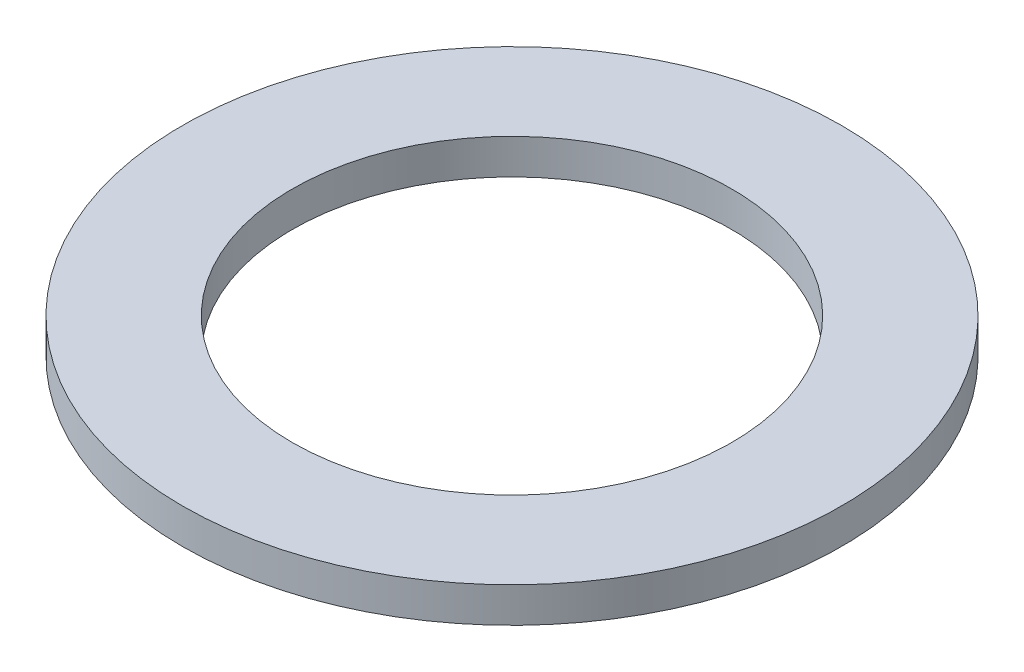
ISO-10303-21;
HEADER;
FILE_DESCRIPTION(('STEP AP214'),'2;1');
FILE_NAME('part.step','',(''),(''),'','','');
FILE_SCHEMA(('AUTOMOTIVE_DESIGN { 1 0 10303 214 1 1 1 1 }'));
ENDSEC;
DATA;
#1=APPLICATION_CONTEXT('core data for automotive mechanical design processes');
#2=APPLICATION_PROTOCOL_DEFINITION('international standard','automotive_design',2000,#1);
#3=PRODUCT_CONTEXT('',#1,'mechanical');
#4=PRODUCT('Part','Part','',(#3));
#5=PRODUCT_RELATED_PRODUCT_CATEGORY('part','',(#4));
#6=PRODUCT_DEFINITION_FORMATION('','',#4);
#7=PRODUCT_DEFINITION_CONTEXT('part definition',#1,'design');
#8=PRODUCT_DEFINITION('design','',#6,#7);
#9=PRODUCT_DEFINITION_SHAPE('','',#8);
#10=(LENGTH_UNIT() NAMED_UNIT(*) SI_UNIT(.MILLI.,.METRE.));
#11=(NAMED_UNIT(*) PLANE_ANGLE_UNIT() SI_UNIT($,.RADIAN.));
#12=(NAMED_UNIT(*) SI_UNIT($,.STERADIAN.) SOLID_ANGLE_UNIT());
#13=UNCERTAINTY_MEASURE_WITH_UNIT(LENGTH_MEASURE(1.E-05),#10,'distance_accuracy_value','');
#14=(GEOMETRIC_REPRESENTATION_CONTEXT(3) GLOBAL_UNCERTAINTY_ASSIGNED_CONTEXT((#13)) GLOBAL_UNIT_ASSIGNED_CONTEXT((#10,
#11,#12)) REPRESENTATION_CONTEXT('',''));
#15=CARTESIAN_POINT('',(0.,0.,0.));
#16=DIRECTION('',(0.,0.,1.));
#17=DIRECTION('',(1.,0.,0.));
#18=AXIS2_PLACEMENT_3D('',#15,#16,#17);
#19=CARTESIAN_POINT('',(0.,1.016,0.));
#20=DIRECTION('',(0.,1.,0.));
#21=DIRECTION('',(0.,0.,1.));
#22=AXIS2_PLACEMENT_3D('',#19,#20,#21);
#23=PLANE('',#22);
#24=CARTESIAN_POINT('',(0.,1.016,0.));
#25=DIRECTION('',(0.,1.,0.));
#26=DIRECTION('',(0.,0.,1.));
#27=AXIS2_PLACEMENT_3D('',#24,#25,#26);
#28=CIRCLE('',#27,9.525);
#29=CARTESIAN_POINT('',(0.,1.016,9.525));
#30=VERTEX_POINT('',#29);
#31=EDGE_CURVE('E10',#30,#30,#28,.T.);
#32=ORIENTED_EDGE('',*,*,#31,.T.);
#33=EDGE_LOOP('',(#32));
#34=FACE_BOUND('',#33,.T.);
#35=CARTESIAN_POINT('',(0.,1.016,0.));
#36=DIRECTION('',(0.,1.,0.));
#37=DIRECTION('',(0.,0.,1.));
#38=AXIS2_PLACEMENT_3D('',#35,#36,#37);
#39=CIRCLE('',#38,6.35);
#40=CARTESIAN_POINT('',(0.,1.016,6.35));
#41=VERTEX_POINT('',#40);
#42=EDGE_CURVE('E42',#41,#41,#39,.T.);
#43=ORIENTED_EDGE('',*,*,#42,.F.);
#44=EDGE_LOOP('',(#43));
#45=FACE_BOUND('',#44,.T.);
#46=ADVANCED_FACE('F31',(#34,#45),#23,.T.);
#47=CARTESIAN_POINT('',(0.,0.,0.));
#48=DIRECTION('',(0.,1.,0.));
#49=DIRECTION('',(0.,0.,1.));
#50=AXIS2_PLACEMENT_3D('',#47,#48,#49);
#51=PLANE('',#50);
#52=CARTESIAN_POINT('',(0.,0.,0.));
#53=DIRECTION('',(0.,1.,0.));
#54=DIRECTION('',(0.,0.,1.));
#55=AXIS2_PLACEMENT_3D('',#52,#53,#54);
#56=CIRCLE('',#55,9.525);
#57=CARTESIAN_POINT('',(0.,0.,9.525));
#58=VERTEX_POINT('',#57);
#59=EDGE_CURVE('E35',#58,#58,#56,.T.);
#60=ORIENTED_EDGE('',*,*,#59,.F.);
#61=EDGE_LOOP('',(#60));
#62=FACE_BOUND('',#61,.T.);
#63=CARTESIAN_POINT('',(0.,0.,0.));
#64=DIRECTION('',(0.,1.,0.));
#65=DIRECTION('',(0.,0.,1.));
#66=AXIS2_PLACEMENT_3D('',#63,#64,#65);
#67=CIRCLE('',#66,6.35);
#68=CARTESIAN_POINT('',(0.,0.,6.35));
#69=VERTEX_POINT('',#68);
#70=EDGE_CURVE('E44',#69,#69,#67,.T.);
#71=ORIENTED_EDGE('',*,*,#70,.T.);
#72=EDGE_LOOP('',(#71));
#73=FACE_BOUND('',#72,.T.);
#74=ADVANCED_FACE('F54',(#62,#73),#51,.F.);
#75=CARTESIAN_POINT('',(0.,1.016,0.));
#76=DIRECTION('',(0.,-1.,0.));
#77=DIRECTION('',(0.,0.,-1.));
#78=AXIS2_PLACEMENT_3D('',#75,#76,#77);
#79=CYLINDRICAL_SURFACE('',#78,9.525);
#80=ORIENTED_EDGE('',*,*,#31,.F.);
#81=EDGE_LOOP('',(#80));
#82=FACE_BOUND('',#81,.T.);
#83=ORIENTED_EDGE('',*,*,#59,.T.);
#84=EDGE_LOOP('',(#83));
#85=FACE_BOUND('',#84,.T.);
#86=ADVANCED_FACE('F33',(#82,#85),#79,.T.);
#87=CARTESIAN_POINT('',(0.,1.016,0.));
#88=DIRECTION('',(0.,-1.,0.));
#89=DIRECTION('',(0.,0.,-1.));
#90=AXIS2_PLACEMENT_3D('',#87,#88,#89);
#91=CYLINDRICAL_SURFACE('',#90,6.35);
#92=ORIENTED_EDGE('',*,*,#42,.T.);
#93=EDGE_LOOP('',(#92));
#94=FACE_BOUND('',#93,.T.);
#95=ORIENTED_EDGE('',*,*,#70,.F.);
#96=EDGE_LOOP('',(#95));
#97=FACE_BOUND('',#96,.T.);
#98=ADVANCED_FACE('F50',(#94,#97),#91,.F.);
#99=CLOSED_SHELL('',(#46,#74,#86,#98));
#100=MANIFOLD_SOLID_BREP('B2',#99);
#101=ADVANCED_BREP_SHAPE_REPRESENTATION('',(#18,#100),#14);
#102=SHAPE_DEFINITION_REPRESENTATION(#9,#101);
ENDSEC;
END-ISO-10303-21;
